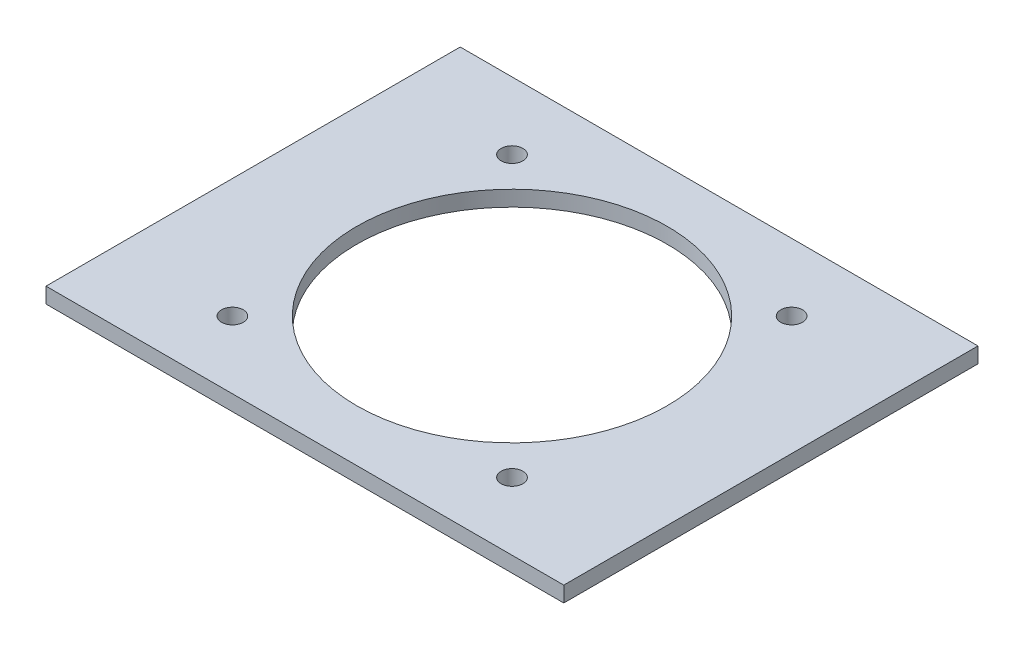
ISO-10303-21;
HEADER;
FILE_DESCRIPTION(('STEP AP214'),'2;1');
FILE_NAME('part.step','',(''),(''),'','','');
FILE_SCHEMA(('AUTOMOTIVE_DESIGN { 1 0 10303 214 1 1 1 1 }'));
ENDSEC;
DATA;
#1=APPLICATION_CONTEXT('core data for automotive mechanical design processes');
#2=APPLICATION_PROTOCOL_DEFINITION('international standard','automotive_design',2000,#1);
#3=PRODUCT_CONTEXT('',#1,'mechanical');
#4=PRODUCT('Part','Part','',(#3));
#5=PRODUCT_RELATED_PRODUCT_CATEGORY('part','',(#4));
#6=PRODUCT_DEFINITION_FORMATION('','',#4);
#7=PRODUCT_DEFINITION_CONTEXT('part definition',#1,'design');
#8=PRODUCT_DEFINITION('design','',#6,#7);
#9=PRODUCT_DEFINITION_SHAPE('','',#8);
#10=(LENGTH_UNIT() NAMED_UNIT(*) SI_UNIT(.MILLI.,.METRE.));
#11=(NAMED_UNIT(*) PLANE_ANGLE_UNIT() SI_UNIT($,.RADIAN.));
#12=(NAMED_UNIT(*) SI_UNIT($,.STERADIAN.) SOLID_ANGLE_UNIT());
#13=UNCERTAINTY_MEASURE_WITH_UNIT(LENGTH_MEASURE(1.E-05),#10,'distance_accuracy_value','');
#14=(GEOMETRIC_REPRESENTATION_CONTEXT(3) GLOBAL_UNCERTAINTY_ASSIGNED_CONTEXT((#13)) GLOBAL_UNIT_ASSIGNED_CONTEXT((#10,
#11,#12)) REPRESENTATION_CONTEXT('',''));
#15=CARTESIAN_POINT('',(0.,0.,0.));
#16=DIRECTION('',(0.,0.,1.));
#17=DIRECTION('',(1.,0.,0.));
#18=AXIS2_PLACEMENT_3D('',#15,#16,#17);
#19=CARTESIAN_POINT('',(0.,3.,0.));
#20=DIRECTION('',(0.,1.,0.));
#21=DIRECTION('',(0.,0.,1.));
#22=AXIS2_PLACEMENT_3D('',#19,#20,#21);
#23=PLANE('',#22);
#24=CARTESIAN_POINT('',(-27.0000000000001,3.,-26.9999999999999));
#25=DIRECTION('',(0.,1.,0.));
#26=DIRECTION('',(1.,0.,0.));
#27=AXIS2_PLACEMENT_3D('',#24,#25,#26);
#28=CIRCLE('',#27,2.1);
#29=CARTESIAN_POINT('',(-24.9000000000001,3.,-26.9999999999999));
#30=VERTEX_POINT('',#29);
#31=EDGE_CURVE('E123',#30,#30,#28,.T.);
#32=ORIENTED_EDGE('',*,*,#31,.F.);
#33=EDGE_LOOP('',(#32));
#34=FACE_BOUND('',#33,.T.);
#35=CARTESIAN_POINT('',(-27.,3.,27.));
#36=DIRECTION('',(0.,1.,0.));
#37=DIRECTION('',(0.,0.,-1.));
#38=AXIS2_PLACEMENT_3D('',#35,#36,#37);
#39=CIRCLE('',#38,2.1);
#40=CARTESIAN_POINT('',(-27.,3.,24.9));
#41=VERTEX_POINT('',#40);
#42=EDGE_CURVE('E221',#41,#41,#39,.T.);
#43=ORIENTED_EDGE('',*,*,#42,.F.);
#44=EDGE_LOOP('',(#43));
#45=FACE_BOUND('',#44,.T.);
#46=CARTESIAN_POINT('',(27.0000000000003,3.,26.9999999999997));
#47=DIRECTION('',(0.,1.,0.));
#48=DIRECTION('',(-1.,0.,0.));
#49=AXIS2_PLACEMENT_3D('',#46,#47,#48);
#50=CIRCLE('',#49,2.1);
#51=CARTESIAN_POINT('',(24.9000000000003,3.,26.9999999999997));
#52=VERTEX_POINT('',#51);
#53=EDGE_CURVE('E136',#52,#52,#50,.T.);
#54=ORIENTED_EDGE('',*,*,#53,.F.);
#55=EDGE_LOOP('',(#54));
#56=FACE_BOUND('',#55,.T.);
#57=CARTESIAN_POINT('',(27.,3.,-27.));
#58=DIRECTION('',(0.,1.,0.));
#59=DIRECTION('',(0.,0.,1.));
#60=AXIS2_PLACEMENT_3D('',#57,#58,#59);
#61=CIRCLE('',#60,2.1);
#62=CARTESIAN_POINT('',(27.,3.,-24.9));
#63=VERTEX_POINT('',#62);
#64=EDGE_CURVE('E119',#63,#63,#61,.T.);
#65=ORIENTED_EDGE('',*,*,#64,.F.);
#66=EDGE_LOOP('',(#65));
#67=FACE_BOUND('',#66,.T.);
#68=DIRECTION('',(0.,0.,-1.));
#69=VECTOR('',#68,1.);
#70=CARTESIAN_POINT('',(50.,3.,-40.));
#71=LINE('',#70,#69);
#72=CARTESIAN_POINT('',(50.,3.,40.));
#73=VERTEX_POINT('',#72);
#74=CARTESIAN_POINT('',(50.,3.,-40.));
#75=VERTEX_POINT('',#74);
#76=EDGE_CURVE('E93',#73,#75,#71,.T.);
#77=ORIENTED_EDGE('',*,*,#76,.T.);
#78=DIRECTION('',(-1.,0.,0.));
#79=VECTOR('',#78,1.);
#80=CARTESIAN_POINT('',(-50.,3.,-40.));
#81=LINE('',#80,#79);
#82=CARTESIAN_POINT('',(-50.,3.,-40.));
#83=VERTEX_POINT('',#82);
#84=EDGE_CURVE('E88',#75,#83,#81,.T.);
#85=ORIENTED_EDGE('',*,*,#84,.T.);
#86=DIRECTION('',(0.,0.,1.));
#87=VECTOR('',#86,1.);
#88=CARTESIAN_POINT('',(-50.,3.,-40.));
#89=LINE('',#88,#87);
#90=CARTESIAN_POINT('',(-50.,3.,40.));
#91=VERTEX_POINT('',#90);
#92=EDGE_CURVE('E91',#83,#91,#89,.T.);
#93=ORIENTED_EDGE('',*,*,#92,.T.);
#94=DIRECTION('',(1.,0.,0.));
#95=VECTOR('',#94,1.);
#96=CARTESIAN_POINT('',(-50.,3.,40.));
#97=LINE('',#96,#95);
#98=EDGE_CURVE('E58',#91,#73,#97,.T.);
#99=ORIENTED_EDGE('',*,*,#98,.T.);
#100=EDGE_LOOP('',(#77,#85,#93,#99));
#101=FACE_BOUND('',#100,.T.);
#102=CARTESIAN_POINT('',(0.,3.,0.));
#103=DIRECTION('',(0.,1.,0.));
#104=DIRECTION('',(0.,0.,1.));
#105=AXIS2_PLACEMENT_3D('',#102,#103,#104);
#106=CIRCLE('',#105,30.);
#107=CARTESIAN_POINT('',(0.,3.,30.));
#108=VERTEX_POINT('',#107);
#109=EDGE_CURVE('E109',#108,#108,#106,.T.);
#110=ORIENTED_EDGE('',*,*,#109,.F.);
#111=EDGE_LOOP('',(#110));
#112=FACE_BOUND('',#111,.T.);
#113=ADVANCED_FACE('F39',(#34,#45,#56,#67,#101,#112),#23,.T.);
#114=CARTESIAN_POINT('',(0.,0.,0.));
#115=DIRECTION('',(0.,1.,0.));
#116=DIRECTION('',(0.,0.,1.));
#117=AXIS2_PLACEMENT_3D('',#114,#115,#116);
#118=PLANE('',#117);
#119=CARTESIAN_POINT('',(-27.0000000000001,0.,-26.9999999999999));
#120=DIRECTION('',(0.,1.,0.));
#121=DIRECTION('',(0.,0.,1.));
#122=AXIS2_PLACEMENT_3D('',#119,#120,#121);
#123=CIRCLE('',#122,2.1);
#124=CARTESIAN_POINT('',(-27.0000000000001,0.,-24.8999999999999));
#125=VERTEX_POINT('',#124);
#126=EDGE_CURVE('E43',#125,#125,#123,.T.);
#127=ORIENTED_EDGE('',*,*,#126,.T.);
#128=EDGE_LOOP('',(#127));
#129=FACE_BOUND('',#128,.T.);
#130=CARTESIAN_POINT('',(-27.,0.,27.));
#131=DIRECTION('',(0.,1.,0.));
#132=DIRECTION('',(0.,0.,1.));
#133=AXIS2_PLACEMENT_3D('',#130,#131,#132);
#134=CIRCLE('',#133,2.1);
#135=CARTESIAN_POINT('',(-27.,0.,29.1));
#136=VERTEX_POINT('',#135);
#137=EDGE_CURVE('E122',#136,#136,#134,.T.);
#138=ORIENTED_EDGE('',*,*,#137,.T.);
#139=EDGE_LOOP('',(#138));
#140=FACE_BOUND('',#139,.T.);
#141=CARTESIAN_POINT('',(27.0000000000003,0.,26.9999999999997));
#142=DIRECTION('',(0.,1.,0.));
#143=DIRECTION('',(0.,0.,1.));
#144=AXIS2_PLACEMENT_3D('',#141,#142,#143);
#145=CIRCLE('',#144,2.1);
#146=CARTESIAN_POINT('',(27.0000000000003,0.,29.0999999999997));
#147=VERTEX_POINT('',#146);
#148=EDGE_CURVE('E120',#147,#147,#145,.T.);
#149=ORIENTED_EDGE('',*,*,#148,.T.);
#150=EDGE_LOOP('',(#149));
#151=FACE_BOUND('',#150,.T.);
#152=CARTESIAN_POINT('',(27.,0.,-27.));
#153=DIRECTION('',(0.,1.,0.));
#154=DIRECTION('',(0.,0.,1.));
#155=AXIS2_PLACEMENT_3D('',#152,#153,#154);
#156=CIRCLE('',#155,2.1);
#157=CARTESIAN_POINT('',(27.,0.,-24.9));
#158=VERTEX_POINT('',#157);
#159=EDGE_CURVE('E115',#158,#158,#156,.T.);
#160=ORIENTED_EDGE('',*,*,#159,.T.);
#161=EDGE_LOOP('',(#160));
#162=FACE_BOUND('',#161,.T.);
#163=DIRECTION('',(0.,0.,-1.));
#164=VECTOR('',#163,1.);
#165=CARTESIAN_POINT('',(50.,0.,-40.));
#166=LINE('',#165,#164);
#167=CARTESIAN_POINT('',(50.,0.,40.));
#168=VERTEX_POINT('',#167);
#169=CARTESIAN_POINT('',(50.,0.,-40.));
#170=VERTEX_POINT('',#169);
#171=EDGE_CURVE('E106',#168,#170,#166,.T.);
#172=ORIENTED_EDGE('',*,*,#171,.F.);
#173=DIRECTION('',(1.,0.,0.));
#174=VECTOR('',#173,1.);
#175=CARTESIAN_POINT('',(-50.,0.,40.));
#176=LINE('',#175,#174);
#177=CARTESIAN_POINT('',(-50.,0.,40.));
#178=VERTEX_POINT('',#177);
#179=EDGE_CURVE('E81',#178,#168,#176,.T.);
#180=ORIENTED_EDGE('',*,*,#179,.F.);
#181=DIRECTION('',(0.,0.,1.));
#182=VECTOR('',#181,1.);
#183=CARTESIAN_POINT('',(-50.,0.,-40.));
#184=LINE('',#183,#182);
#185=CARTESIAN_POINT('',(-50.,0.,-40.));
#186=VERTEX_POINT('',#185);
#187=EDGE_CURVE('E75',#186,#178,#184,.T.);
#188=ORIENTED_EDGE('',*,*,#187,.F.);
#189=DIRECTION('',(-1.,0.,0.));
#190=VECTOR('',#189,1.);
#191=CARTESIAN_POINT('',(-50.,0.,-40.));
#192=LINE('',#191,#190);
#193=EDGE_CURVE('E97',#170,#186,#192,.T.);
#194=ORIENTED_EDGE('',*,*,#193,.F.);
#195=EDGE_LOOP('',(#172,#180,#188,#194));
#196=FACE_BOUND('',#195,.T.);
#197=CARTESIAN_POINT('',(0.,0.,0.));
#198=DIRECTION('',(0.,1.,0.));
#199=DIRECTION('',(0.,0.,1.));
#200=AXIS2_PLACEMENT_3D('',#197,#198,#199);
#201=CIRCLE('',#200,30.);
#202=CARTESIAN_POINT('',(0.,0.,30.));
#203=VERTEX_POINT('',#202);
#204=EDGE_CURVE('E118',#203,#203,#201,.T.);
#205=ORIENTED_EDGE('',*,*,#204,.T.);
#206=EDGE_LOOP('',(#205));
#207=FACE_BOUND('',#206,.T.);
#208=ADVANCED_FACE('F143',(#129,#140,#151,#162,#196,#207),#118,.F.);
#209=CARTESIAN_POINT('',(50.,3.,-40.));
#210=DIRECTION('',(-1.,0.,0.));
#211=DIRECTION('',(0.,0.,1.));
#212=AXIS2_PLACEMENT_3D('',#209,#210,#211);
#213=PLANE('',#212);
#214=ORIENTED_EDGE('',*,*,#171,.T.);
#215=DIRECTION('',(0.,-1.,0.));
#216=VECTOR('',#215,1.);
#217=CARTESIAN_POINT('',(50.,3.,-40.));
#218=LINE('',#217,#216);
#219=EDGE_CURVE('E11',#75,#170,#218,.T.);
#220=ORIENTED_EDGE('',*,*,#219,.F.);
#221=ORIENTED_EDGE('',*,*,#76,.F.);
#222=DIRECTION('',(0.,-1.,0.));
#223=VECTOR('',#222,1.);
#224=CARTESIAN_POINT('',(50.,3.,40.));
#225=LINE('',#224,#223);
#226=EDGE_CURVE('E102',#73,#168,#225,.T.);
#227=ORIENTED_EDGE('',*,*,#226,.T.);
#228=EDGE_LOOP('',(#214,#220,#221,#227));
#229=FACE_BOUND('',#228,.T.);
#230=ADVANCED_FACE('F41',(#229),#213,.F.);
#231=CARTESIAN_POINT('',(-50.,3.,-40.));
#232=DIRECTION('',(0.,0.,1.));
#233=DIRECTION('',(1.,0.,0.));
#234=AXIS2_PLACEMENT_3D('',#231,#232,#233);
#235=PLANE('',#234);
#236=ORIENTED_EDGE('',*,*,#193,.T.);
#237=DIRECTION('',(0.,-1.,0.));
#238=VECTOR('',#237,1.);
#239=CARTESIAN_POINT('',(-50.,3.,-40.));
#240=LINE('',#239,#238);
#241=EDGE_CURVE('E49',#83,#186,#240,.T.);
#242=ORIENTED_EDGE('',*,*,#241,.F.);
#243=ORIENTED_EDGE('',*,*,#84,.F.);
#244=ORIENTED_EDGE('',*,*,#219,.T.);
#245=EDGE_LOOP('',(#236,#242,#243,#244));
#246=FACE_BOUND('',#245,.T.);
#247=ADVANCED_FACE('F96',(#246),#235,.F.);
#248=CARTESIAN_POINT('',(-50.,3.,-40.));
#249=DIRECTION('',(1.,0.,0.));
#250=DIRECTION('',(0.,0.,-1.));
#251=AXIS2_PLACEMENT_3D('',#248,#249,#250);
#252=PLANE('',#251);
#253=ORIENTED_EDGE('',*,*,#187,.T.);
#254=DIRECTION('',(0.,-1.,0.));
#255=VECTOR('',#254,1.);
#256=CARTESIAN_POINT('',(-50.,3.,40.));
#257=LINE('',#256,#255);
#258=EDGE_CURVE('E98',#91,#178,#257,.T.);
#259=ORIENTED_EDGE('',*,*,#258,.F.);
#260=ORIENTED_EDGE('',*,*,#92,.F.);
#261=ORIENTED_EDGE('',*,*,#241,.T.);
#262=EDGE_LOOP('',(#253,#259,#260,#261));
#263=FACE_BOUND('',#262,.T.);
#264=ADVANCED_FACE('F100',(#263),#252,.F.);
#265=CARTESIAN_POINT('',(-50.,3.,40.));
#266=DIRECTION('',(0.,0.,-1.));
#267=DIRECTION('',(-1.,0.,0.));
#268=AXIS2_PLACEMENT_3D('',#265,#266,#267);
#269=PLANE('',#268);
#270=ORIENTED_EDGE('',*,*,#179,.T.);
#271=ORIENTED_EDGE('',*,*,#226,.F.);
#272=ORIENTED_EDGE('',*,*,#98,.F.);
#273=ORIENTED_EDGE('',*,*,#258,.T.);
#274=EDGE_LOOP('',(#270,#271,#272,#273));
#275=FACE_BOUND('',#274,.T.);
#276=ADVANCED_FACE('F148',(#275),#269,.F.);
#277=CARTESIAN_POINT('',(0.,3.,0.));
#278=DIRECTION('',(0.,-1.,0.));
#279=DIRECTION('',(0.,0.,-1.));
#280=AXIS2_PLACEMENT_3D('',#277,#278,#279);
#281=CYLINDRICAL_SURFACE('',#280,30.);
#282=ORIENTED_EDGE('',*,*,#109,.T.);
#283=EDGE_LOOP('',(#282));
#284=FACE_BOUND('',#283,.T.);
#285=ORIENTED_EDGE('',*,*,#204,.F.);
#286=EDGE_LOOP('',(#285));
#287=FACE_BOUND('',#286,.T.);
#288=ADVANCED_FACE('F145',(#284,#287),#281,.F.);
#289=CARTESIAN_POINT('',(27.,-7.,-27.));
#290=DIRECTION('',(0.,1.,0.));
#291=DIRECTION('',(0.,0.,1.));
#292=AXIS2_PLACEMENT_3D('',#289,#290,#291);
#293=CYLINDRICAL_SURFACE('',#292,2.1);
#294=ORIENTED_EDGE('',*,*,#64,.T.);
#295=EDGE_LOOP('',(#294));
#296=FACE_BOUND('',#295,.T.);
#297=ORIENTED_EDGE('',*,*,#159,.F.);
#298=EDGE_LOOP('',(#297));
#299=FACE_BOUND('',#298,.T.);
#300=ADVANCED_FACE('F147',(#296,#299),#293,.F.);
#301=CARTESIAN_POINT('',(27.0000000000003,-7.,26.9999999999997));
#302=DIRECTION('',(0.,1.,0.));
#303=DIRECTION('',(0.,0.,1.));
#304=AXIS2_PLACEMENT_3D('',#301,#302,#303);
#305=CYLINDRICAL_SURFACE('',#304,2.1);
#306=ORIENTED_EDGE('',*,*,#53,.T.);
#307=EDGE_LOOP('',(#306));
#308=FACE_BOUND('',#307,.T.);
#309=ORIENTED_EDGE('',*,*,#148,.F.);
#310=EDGE_LOOP('',(#309));
#311=FACE_BOUND('',#310,.T.);
#312=ADVANCED_FACE('F155',(#308,#311),#305,.F.);
#313=CARTESIAN_POINT('',(-27.,-7.,27.));
#314=DIRECTION('',(0.,1.,0.));
#315=DIRECTION('',(0.,0.,1.));
#316=AXIS2_PLACEMENT_3D('',#313,#314,#315);
#317=CYLINDRICAL_SURFACE('',#316,2.1);
#318=ORIENTED_EDGE('',*,*,#42,.T.);
#319=EDGE_LOOP('',(#318));
#320=FACE_BOUND('',#319,.T.);
#321=ORIENTED_EDGE('',*,*,#137,.F.);
#322=EDGE_LOOP('',(#321));
#323=FACE_BOUND('',#322,.T.);
#324=ADVANCED_FACE('F194',(#320,#323),#317,.F.);
#325=CARTESIAN_POINT('',(-27.0000000000001,-7.,-26.9999999999999));
#326=DIRECTION('',(0.,1.,0.));
#327=DIRECTION('',(0.,0.,1.));
#328=AXIS2_PLACEMENT_3D('',#325,#326,#327);
#329=CYLINDRICAL_SURFACE('',#328,2.1);
#330=ORIENTED_EDGE('',*,*,#31,.T.);
#331=EDGE_LOOP('',(#330));
#332=FACE_BOUND('',#331,.T.);
#333=ORIENTED_EDGE('',*,*,#126,.F.);
#334=EDGE_LOOP('',(#333));
#335=FACE_BOUND('',#334,.T.);
#336=ADVANCED_FACE('F205',(#332,#335),#329,.F.);
#337=CLOSED_SHELL('',(#113,#208,#230,#247,#264,#276,#288,#300,#312,#324,#336));
#338=MANIFOLD_SOLID_BREP('B2',#337);
#339=ADVANCED_BREP_SHAPE_REPRESENTATION('',(#18,#338),#14);
#340=SHAPE_DEFINITION_REPRESENTATION(#9,#339);
ENDSEC;
END-ISO-10303-21;
